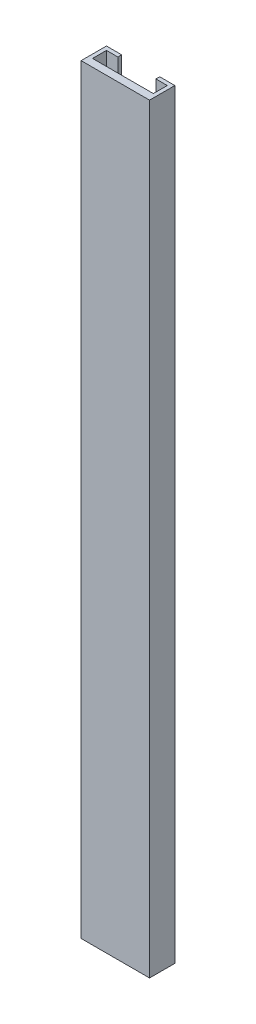
ISO-10303-21;
HEADER;
FILE_DESCRIPTION(('STEP AP214'),'2;1');
FILE_NAME('part.step','',(''),(''),'','','');
FILE_SCHEMA(('AUTOMOTIVE_DESIGN { 1 0 10303 214 1 1 1 1 }'));
ENDSEC;
DATA;
#1=APPLICATION_CONTEXT('core data for automotive mechanical design processes');
#2=APPLICATION_PROTOCOL_DEFINITION('international standard','automotive_design',2000,#1);
#3=PRODUCT_CONTEXT('',#1,'mechanical');
#4=PRODUCT('Part','Part','',(#3));
#5=PRODUCT_RELATED_PRODUCT_CATEGORY('part','',(#4));
#6=PRODUCT_DEFINITION_FORMATION('','',#4);
#7=PRODUCT_DEFINITION_CONTEXT('part definition',#1,'design');
#8=PRODUCT_DEFINITION('design','',#6,#7);
#9=PRODUCT_DEFINITION_SHAPE('','',#8);
#10=(LENGTH_UNIT() NAMED_UNIT(*) SI_UNIT(.MILLI.,.METRE.));
#11=(NAMED_UNIT(*) PLANE_ANGLE_UNIT() SI_UNIT($,.RADIAN.));
#12=(NAMED_UNIT(*) SI_UNIT($,.STERADIAN.) SOLID_ANGLE_UNIT());
#13=UNCERTAINTY_MEASURE_WITH_UNIT(LENGTH_MEASURE(1.E-05),#10,'distance_accuracy_value','');
#14=(GEOMETRIC_REPRESENTATION_CONTEXT(3) GLOBAL_UNCERTAINTY_ASSIGNED_CONTEXT((#13)) GLOBAL_UNIT_ASSIGNED_CONTEXT((#10,
#11,#12)) REPRESENTATION_CONTEXT('',''));
#15=CARTESIAN_POINT('',(0.,0.,0.));
#16=DIRECTION('',(0.,0.,1.));
#17=DIRECTION('',(1.,0.,0.));
#18=AXIS2_PLACEMENT_3D('',#15,#16,#17);
#19=CARTESIAN_POINT('',(13.5,300.,0.));
#20=DIRECTION('',(-1.,0.,0.));
#21=DIRECTION('',(0.,0.,1.));
#22=AXIS2_PLACEMENT_3D('',#19,#20,#21);
#23=PLANE('',#22);
#24=DIRECTION('',(0.,0.,-1.));
#25=VECTOR('',#24,1.);
#26=CARTESIAN_POINT('',(13.5,0.,0.));
#27=LINE('',#26,#25);
#28=CARTESIAN_POINT('',(13.5,0.,0.));
#29=VERTEX_POINT('',#28);
#30=CARTESIAN_POINT('',(13.5,0.,-10.));
#31=VERTEX_POINT('',#30);
#32=EDGE_CURVE('E164',#29,#31,#27,.T.);
#33=ORIENTED_EDGE('',*,*,#32,.T.);
#34=DIRECTION('',(0.,-1.,0.));
#35=VECTOR('',#34,1.);
#36=CARTESIAN_POINT('',(13.5,300.,-10.));
#37=LINE('',#36,#35);
#38=CARTESIAN_POINT('',(13.5,300.,-10.));
#39=VERTEX_POINT('',#38);
#40=EDGE_CURVE('E11',#39,#31,#37,.T.);
#41=ORIENTED_EDGE('',*,*,#40,.F.);
#42=DIRECTION('',(0.,0.,-1.));
#43=VECTOR('',#42,1.);
#44=CARTESIAN_POINT('',(13.5,300.,0.));
#45=LINE('',#44,#43);
#46=CARTESIAN_POINT('',(13.5,300.,0.));
#47=VERTEX_POINT('',#46);
#48=EDGE_CURVE('E198',#47,#39,#45,.T.);
#49=ORIENTED_EDGE('',*,*,#48,.F.);
#50=DIRECTION('',(0.,-1.,0.));
#51=VECTOR('',#50,1.);
#52=CARTESIAN_POINT('',(13.5,300.,0.));
#53=LINE('',#52,#51);
#54=EDGE_CURVE('E160',#47,#29,#53,.T.);
#55=ORIENTED_EDGE('',*,*,#54,.T.);
#56=EDGE_LOOP('',(#33,#41,#49,#55));
#57=FACE_BOUND('',#56,.T.);
#58=ADVANCED_FACE('F39',(#57),#23,.F.);
#59=CARTESIAN_POINT('',(13.5,300.,-10.));
#60=DIRECTION('',(0.,0.,1.));
#61=DIRECTION('',(1.,0.,0.));
#62=AXIS2_PLACEMENT_3D('',#59,#60,#61);
#63=PLANE('',#62);
#64=DIRECTION('',(-1.,0.,0.));
#65=VECTOR('',#64,1.);
#66=CARTESIAN_POINT('',(13.5,0.,-10.));
#67=LINE('',#66,#65);
#68=CARTESIAN_POINT('',(7.5,0.,-10.));
#69=VERTEX_POINT('',#68);
#70=EDGE_CURVE('E168',#31,#69,#67,.T.);
#71=ORIENTED_EDGE('',*,*,#70,.T.);
#72=DIRECTION('',(0.,-1.,0.));
#73=VECTOR('',#72,1.);
#74=CARTESIAN_POINT('',(7.5,300.,-10.));
#75=LINE('',#74,#73);
#76=CARTESIAN_POINT('',(7.5,300.,-10.));
#77=VERTEX_POINT('',#76);
#78=EDGE_CURVE('E48',#77,#69,#75,.T.);
#79=ORIENTED_EDGE('',*,*,#78,.F.);
#80=DIRECTION('',(-1.,0.,0.));
#81=VECTOR('',#80,1.);
#82=CARTESIAN_POINT('',(13.5,300.,-10.));
#83=LINE('',#82,#81);
#84=EDGE_CURVE('E111',#39,#77,#83,.T.);
#85=ORIENTED_EDGE('',*,*,#84,.F.);
#86=ORIENTED_EDGE('',*,*,#40,.T.);
#87=EDGE_LOOP('',(#71,#79,#85,#86));
#88=FACE_BOUND('',#87,.T.);
#89=ADVANCED_FACE('F292',(#88),#63,.F.);
#90=CARTESIAN_POINT('',(7.5,300.,-10.));
#91=DIRECTION('',(1.,0.,0.));
#92=DIRECTION('',(0.,0.,-1.));
#93=AXIS2_PLACEMENT_3D('',#90,#91,#92);
#94=PLANE('',#93);
#95=DIRECTION('',(0.,0.,1.));
#96=VECTOR('',#95,1.);
#97=CARTESIAN_POINT('',(7.5,0.,-10.));
#98=LINE('',#97,#96);
#99=CARTESIAN_POINT('',(7.5,0.,-8.5));
#100=VERTEX_POINT('',#99);
#101=EDGE_CURVE('E171',#69,#100,#98,.T.);
#102=ORIENTED_EDGE('',*,*,#101,.T.);
#103=DIRECTION('',(0.,-1.,0.));
#104=VECTOR('',#103,1.);
#105=CARTESIAN_POINT('',(7.5,300.,-8.5));
#106=LINE('',#105,#104);
#107=CARTESIAN_POINT('',(7.5,300.,-8.5));
#108=VERTEX_POINT('',#107);
#109=EDGE_CURVE('E225',#108,#100,#106,.T.);
#110=ORIENTED_EDGE('',*,*,#109,.F.);
#111=DIRECTION('',(0.,0.,1.));
#112=VECTOR('',#111,1.);
#113=CARTESIAN_POINT('',(7.5,300.,-10.));
#114=LINE('',#113,#112);
#115=EDGE_CURVE('E235',#77,#108,#114,.T.);
#116=ORIENTED_EDGE('',*,*,#115,.F.);
#117=ORIENTED_EDGE('',*,*,#78,.T.);
#118=EDGE_LOOP('',(#102,#110,#116,#117));
#119=FACE_BOUND('',#118,.T.);
#120=ADVANCED_FACE('F233',(#119),#94,.F.);
#121=CARTESIAN_POINT('',(7.5,300.,-8.5));
#122=DIRECTION('',(0.,0.,-1.));
#123=DIRECTION('',(-1.,0.,0.));
#124=AXIS2_PLACEMENT_3D('',#121,#122,#123);
#125=PLANE('',#124);
#126=DIRECTION('',(1.,0.,0.));
#127=VECTOR('',#126,1.);
#128=CARTESIAN_POINT('',(7.5,0.,-8.5));
#129=LINE('',#128,#127);
#130=CARTESIAN_POINT('',(12.,0.,-8.5));
#131=VERTEX_POINT('',#130);
#132=EDGE_CURVE('E174',#100,#131,#129,.T.);
#133=ORIENTED_EDGE('',*,*,#132,.T.);
#134=DIRECTION('',(0.,-1.,0.));
#135=VECTOR('',#134,1.);
#136=CARTESIAN_POINT('',(12.,300.,-8.5));
#137=LINE('',#136,#135);
#138=CARTESIAN_POINT('',(12.,300.,-8.5));
#139=VERTEX_POINT('',#138);
#140=EDGE_CURVE('E221',#139,#131,#137,.T.);
#141=ORIENTED_EDGE('',*,*,#140,.F.);
#142=DIRECTION('',(1.,0.,0.));
#143=VECTOR('',#142,1.);
#144=CARTESIAN_POINT('',(7.5,300.,-8.5));
#145=LINE('',#144,#143);
#146=EDGE_CURVE('E254',#108,#139,#145,.T.);
#147=ORIENTED_EDGE('',*,*,#146,.F.);
#148=ORIENTED_EDGE('',*,*,#109,.T.);
#149=EDGE_LOOP('',(#133,#141,#147,#148));
#150=FACE_BOUND('',#149,.T.);
#151=ADVANCED_FACE('F244',(#150),#125,.F.);
#152=CARTESIAN_POINT('',(12.,300.,-8.5));
#153=DIRECTION('',(1.,0.,0.));
#154=DIRECTION('',(0.,0.,-1.));
#155=AXIS2_PLACEMENT_3D('',#152,#153,#154);
#156=PLANE('',#155);
#157=DIRECTION('',(0.,0.,1.));
#158=VECTOR('',#157,1.);
#159=CARTESIAN_POINT('',(12.,0.,-8.5));
#160=LINE('',#159,#158);
#161=CARTESIAN_POINT('',(12.,0.,-3.));
#162=VERTEX_POINT('',#161);
#163=EDGE_CURVE('E177',#131,#162,#160,.T.);
#164=ORIENTED_EDGE('',*,*,#163,.T.);
#165=DIRECTION('',(0.,-1.,0.));
#166=VECTOR('',#165,1.);
#167=CARTESIAN_POINT('',(12.,300.,-3.));
#168=LINE('',#167,#166);
#169=CARTESIAN_POINT('',(12.,300.,-3.));
#170=VERTEX_POINT('',#169);
#171=EDGE_CURVE('E217',#170,#162,#168,.T.);
#172=ORIENTED_EDGE('',*,*,#171,.F.);
#173=DIRECTION('',(0.,0.,1.));
#174=VECTOR('',#173,1.);
#175=CARTESIAN_POINT('',(12.,300.,-8.5));
#176=LINE('',#175,#174);
#177=EDGE_CURVE('E250',#139,#170,#176,.T.);
#178=ORIENTED_EDGE('',*,*,#177,.F.);
#179=ORIENTED_EDGE('',*,*,#140,.T.);
#180=EDGE_LOOP('',(#164,#172,#178,#179));
#181=FACE_BOUND('',#180,.T.);
#182=ADVANCED_FACE('F248',(#181),#156,.F.);
#183=CARTESIAN_POINT('',(12.,300.,-3.));
#184=DIRECTION('',(0.,0.,1.));
#185=DIRECTION('',(1.,0.,0.));
#186=AXIS2_PLACEMENT_3D('',#183,#184,#185);
#187=PLANE('',#186);
#188=DIRECTION('',(-1.,0.,0.));
#189=VECTOR('',#188,1.);
#190=CARTESIAN_POINT('',(12.,0.,-3.));
#191=LINE('',#190,#189);
#192=CARTESIAN_POINT('',(-12.,0.,-3.));
#193=VERTEX_POINT('',#192);
#194=EDGE_CURVE('E180',#162,#193,#191,.T.);
#195=ORIENTED_EDGE('',*,*,#194,.T.);
#196=DIRECTION('',(0.,-1.,0.));
#197=VECTOR('',#196,1.);
#198=CARTESIAN_POINT('',(-12.,300.,-3.));
#199=LINE('',#198,#197);
#200=CARTESIAN_POINT('',(-12.,300.,-3.));
#201=VERTEX_POINT('',#200);
#202=EDGE_CURVE('E213',#201,#193,#199,.T.);
#203=ORIENTED_EDGE('',*,*,#202,.F.);
#204=DIRECTION('',(-1.,0.,0.));
#205=VECTOR('',#204,1.);
#206=CARTESIAN_POINT('',(12.,300.,-3.));
#207=LINE('',#206,#205);
#208=EDGE_CURVE('E253',#170,#201,#207,.T.);
#209=ORIENTED_EDGE('',*,*,#208,.F.);
#210=ORIENTED_EDGE('',*,*,#171,.T.);
#211=EDGE_LOOP('',(#195,#203,#209,#210));
#212=FACE_BOUND('',#211,.T.);
#213=ADVANCED_FACE('F305',(#212),#187,.F.);
#214=CARTESIAN_POINT('',(-12.,300.,-8.5));
#215=DIRECTION('',(-1.,0.,0.));
#216=DIRECTION('',(0.,0.,1.));
#217=AXIS2_PLACEMENT_3D('',#214,#215,#216);
#218=PLANE('',#217);
#219=DIRECTION('',(0.,0.,-1.));
#220=VECTOR('',#219,1.);
#221=CARTESIAN_POINT('',(-12.,0.,-8.5));
#222=LINE('',#221,#220);
#223=CARTESIAN_POINT('',(-12.,0.,-8.5));
#224=VERTEX_POINT('',#223);
#225=EDGE_CURVE('E183',#193,#224,#222,.T.);
#226=ORIENTED_EDGE('',*,*,#225,.T.);
#227=DIRECTION('',(0.,-1.,0.));
#228=VECTOR('',#227,1.);
#229=CARTESIAN_POINT('',(-12.,300.,-8.5));
#230=LINE('',#229,#228);
#231=CARTESIAN_POINT('',(-12.,300.,-8.5));
#232=VERTEX_POINT('',#231);
#233=EDGE_CURVE('E209',#232,#224,#230,.T.);
#234=ORIENTED_EDGE('',*,*,#233,.F.);
#235=DIRECTION('',(0.,0.,-1.));
#236=VECTOR('',#235,1.);
#237=CARTESIAN_POINT('',(-12.,300.,-8.5));
#238=LINE('',#237,#236);
#239=EDGE_CURVE('E258',#201,#232,#238,.T.);
#240=ORIENTED_EDGE('',*,*,#239,.F.);
#241=ORIENTED_EDGE('',*,*,#202,.T.);
#242=EDGE_LOOP('',(#226,#234,#240,#241));
#243=FACE_BOUND('',#242,.T.);
#244=ADVANCED_FACE('F308',(#243),#218,.F.);
#245=CARTESIAN_POINT('',(-7.5,300.,-8.5));
#246=DIRECTION('',(0.,0.,-1.));
#247=DIRECTION('',(-1.,0.,0.));
#248=AXIS2_PLACEMENT_3D('',#245,#246,#247);
#249=PLANE('',#248);
#250=DIRECTION('',(1.,0.,0.));
#251=VECTOR('',#250,1.);
#252=CARTESIAN_POINT('',(-7.5,0.,-8.5));
#253=LINE('',#252,#251);
#254=CARTESIAN_POINT('',(-7.5,0.,-8.5));
#255=VERTEX_POINT('',#254);
#256=EDGE_CURVE('E186',#224,#255,#253,.T.);
#257=ORIENTED_EDGE('',*,*,#256,.T.);
#258=DIRECTION('',(0.,-1.,0.));
#259=VECTOR('',#258,1.);
#260=CARTESIAN_POINT('',(-7.5,300.,-8.5));
#261=LINE('',#260,#259);
#262=CARTESIAN_POINT('',(-7.5,300.,-8.5));
#263=VERTEX_POINT('',#262);
#264=EDGE_CURVE('E205',#263,#255,#261,.T.);
#265=ORIENTED_EDGE('',*,*,#264,.F.);
#266=DIRECTION('',(1.,0.,0.));
#267=VECTOR('',#266,1.);
#268=CARTESIAN_POINT('',(-7.5,300.,-8.5));
#269=LINE('',#268,#267);
#270=EDGE_CURVE('E265',#232,#263,#269,.T.);
#271=ORIENTED_EDGE('',*,*,#270,.F.);
#272=ORIENTED_EDGE('',*,*,#233,.T.);
#273=EDGE_LOOP('',(#257,#265,#271,#272));
#274=FACE_BOUND('',#273,.T.);
#275=ADVANCED_FACE('F273',(#274),#249,.F.);
#276=CARTESIAN_POINT('',(-7.5,300.,-10.));
#277=DIRECTION('',(-1.,0.,0.));
#278=DIRECTION('',(0.,0.,1.));
#279=AXIS2_PLACEMENT_3D('',#276,#277,#278);
#280=PLANE('',#279);
#281=DIRECTION('',(0.,0.,-1.));
#282=VECTOR('',#281,1.);
#283=CARTESIAN_POINT('',(-7.5,0.,-10.));
#284=LINE('',#283,#282);
#285=CARTESIAN_POINT('',(-7.5,0.,-10.));
#286=VERTEX_POINT('',#285);
#287=EDGE_CURVE('E189',#255,#286,#284,.T.);
#288=ORIENTED_EDGE('',*,*,#287,.T.);
#289=DIRECTION('',(0.,-1.,0.));
#290=VECTOR('',#289,1.);
#291=CARTESIAN_POINT('',(-7.5,300.,-10.));
#292=LINE('',#291,#290);
#293=CARTESIAN_POINT('',(-7.5,300.,-10.));
#294=VERTEX_POINT('',#293);
#295=EDGE_CURVE('E153',#294,#286,#292,.T.);
#296=ORIENTED_EDGE('',*,*,#295,.F.);
#297=DIRECTION('',(0.,0.,-1.));
#298=VECTOR('',#297,1.);
#299=CARTESIAN_POINT('',(-7.5,300.,-10.));
#300=LINE('',#299,#298);
#301=EDGE_CURVE('E142',#263,#294,#300,.T.);
#302=ORIENTED_EDGE('',*,*,#301,.F.);
#303=ORIENTED_EDGE('',*,*,#264,.T.);
#304=EDGE_LOOP('',(#288,#296,#302,#303));
#305=FACE_BOUND('',#304,.T.);
#306=ADVANCED_FACE('F277',(#305),#280,.F.);
#307=CARTESIAN_POINT('',(-13.5,300.,-10.));
#308=DIRECTION('',(0.,0.,1.));
#309=DIRECTION('',(1.,0.,0.));
#310=AXIS2_PLACEMENT_3D('',#307,#308,#309);
#311=PLANE('',#310);
#312=DIRECTION('',(-1.,0.,0.));
#313=VECTOR('',#312,1.);
#314=CARTESIAN_POINT('',(-13.5,0.,-10.));
#315=LINE('',#314,#313);
#316=CARTESIAN_POINT('',(-13.5,0.,-10.));
#317=VERTEX_POINT('',#316);
#318=EDGE_CURVE('E151',#286,#317,#315,.T.);
#319=ORIENTED_EDGE('',*,*,#318,.T.);
#320=DIRECTION('',(0.,-1.,0.));
#321=VECTOR('',#320,1.);
#322=CARTESIAN_POINT('',(-13.5,300.,-10.));
#323=LINE('',#322,#321);
#324=CARTESIAN_POINT('',(-13.5,300.,-10.));
#325=VERTEX_POINT('',#324);
#326=EDGE_CURVE('E148',#325,#317,#323,.T.);
#327=ORIENTED_EDGE('',*,*,#326,.F.);
#328=DIRECTION('',(-1.,0.,0.));
#329=VECTOR('',#328,1.);
#330=CARTESIAN_POINT('',(-13.5,300.,-10.));
#331=LINE('',#330,#329);
#332=EDGE_CURVE('E136',#294,#325,#331,.T.);
#333=ORIENTED_EDGE('',*,*,#332,.F.);
#334=ORIENTED_EDGE('',*,*,#295,.T.);
#335=EDGE_LOOP('',(#319,#327,#333,#334));
#336=FACE_BOUND('',#335,.T.);
#337=ADVANCED_FACE('F149',(#336),#311,.F.);
#338=CARTESIAN_POINT('',(-13.5,300.,0.));
#339=DIRECTION('',(1.,0.,0.));
#340=DIRECTION('',(0.,0.,-1.));
#341=AXIS2_PLACEMENT_3D('',#338,#339,#340);
#342=PLANE('',#341);
#343=DIRECTION('',(0.,0.,1.));
#344=VECTOR('',#343,1.);
#345=CARTESIAN_POINT('',(-13.5,0.,0.));
#346=LINE('',#345,#344);
#347=CARTESIAN_POINT('',(-13.5,0.,0.));
#348=VERTEX_POINT('',#347);
#349=EDGE_CURVE('E97',#317,#348,#346,.T.);
#350=ORIENTED_EDGE('',*,*,#349,.T.);
#351=DIRECTION('',(0.,-1.,0.));
#352=VECTOR('',#351,1.);
#353=CARTESIAN_POINT('',(-13.5,300.,0.));
#354=LINE('',#353,#352);
#355=CARTESIAN_POINT('',(-13.5,300.,0.));
#356=VERTEX_POINT('',#355);
#357=EDGE_CURVE('E154',#356,#348,#354,.T.);
#358=ORIENTED_EDGE('',*,*,#357,.F.);
#359=DIRECTION('',(0.,0.,1.));
#360=VECTOR('',#359,1.);
#361=CARTESIAN_POINT('',(-13.5,300.,0.));
#362=LINE('',#361,#360);
#363=EDGE_CURVE('E140',#325,#356,#362,.T.);
#364=ORIENTED_EDGE('',*,*,#363,.F.);
#365=ORIENTED_EDGE('',*,*,#326,.T.);
#366=EDGE_LOOP('',(#350,#358,#364,#365));
#367=FACE_BOUND('',#366,.T.);
#368=ADVANCED_FACE('F156',(#367),#342,.F.);
#369=CARTESIAN_POINT('',(-13.5,300.,0.));
#370=DIRECTION('',(0.,0.,-1.));
#371=DIRECTION('',(-1.,0.,0.));
#372=AXIS2_PLACEMENT_3D('',#369,#370,#371);
#373=PLANE('',#372);
#374=DIRECTION('',(1.,0.,0.));
#375=VECTOR('',#374,1.);
#376=CARTESIAN_POINT('',(-13.5,0.,0.));
#377=LINE('',#376,#375);
#378=EDGE_CURVE('E103',#348,#29,#377,.T.);
#379=ORIENTED_EDGE('',*,*,#378,.T.);
#380=ORIENTED_EDGE('',*,*,#54,.F.);
#381=DIRECTION('',(1.,0.,0.));
#382=VECTOR('',#381,1.);
#383=CARTESIAN_POINT('',(-13.5,300.,0.));
#384=LINE('',#383,#382);
#385=EDGE_CURVE('E56',#356,#47,#384,.T.);
#386=ORIENTED_EDGE('',*,*,#385,.F.);
#387=ORIENTED_EDGE('',*,*,#357,.T.);
#388=EDGE_LOOP('',(#379,#380,#386,#387));
#389=FACE_BOUND('',#388,.T.);
#390=ADVANCED_FACE('F281',(#389),#373,.F.);
#391=CARTESIAN_POINT('',(0.,300.,0.));
#392=DIRECTION('',(0.,1.,0.));
#393=DIRECTION('',(0.,0.,1.));
#394=AXIS2_PLACEMENT_3D('',#391,#392,#393);
#395=PLANE('',#394);
#396=ORIENTED_EDGE('',*,*,#48,.T.);
#397=ORIENTED_EDGE('',*,*,#84,.T.);
#398=ORIENTED_EDGE('',*,*,#115,.T.);
#399=ORIENTED_EDGE('',*,*,#146,.T.);
#400=ORIENTED_EDGE('',*,*,#177,.T.);
#401=ORIENTED_EDGE('',*,*,#208,.T.);
#402=ORIENTED_EDGE('',*,*,#239,.T.);
#403=ORIENTED_EDGE('',*,*,#270,.T.);
#404=ORIENTED_EDGE('',*,*,#301,.T.);
#405=ORIENTED_EDGE('',*,*,#332,.T.);
#406=ORIENTED_EDGE('',*,*,#363,.T.);
#407=ORIENTED_EDGE('',*,*,#385,.T.);
#408=EDGE_LOOP('',(#396,#397,#398,#399,#400,#401,#402,#403,#404,#405,#406,#407));
#409=FACE_BOUND('',#408,.T.);
#410=ADVANCED_FACE('F138',(#409),#395,.T.);
#411=CARTESIAN_POINT('',(0.,0.,0.));
#412=DIRECTION('',(0.,1.,0.));
#413=DIRECTION('',(0.,0.,1.));
#414=AXIS2_PLACEMENT_3D('',#411,#412,#413);
#415=PLANE('',#414);
#416=ORIENTED_EDGE('',*,*,#32,.F.);
#417=ORIENTED_EDGE('',*,*,#378,.F.);
#418=ORIENTED_EDGE('',*,*,#349,.F.);
#419=ORIENTED_EDGE('',*,*,#318,.F.);
#420=ORIENTED_EDGE('',*,*,#287,.F.);
#421=ORIENTED_EDGE('',*,*,#256,.F.);
#422=ORIENTED_EDGE('',*,*,#225,.F.);
#423=ORIENTED_EDGE('',*,*,#194,.F.);
#424=ORIENTED_EDGE('',*,*,#163,.F.);
#425=ORIENTED_EDGE('',*,*,#132,.F.);
#426=ORIENTED_EDGE('',*,*,#101,.F.);
#427=ORIENTED_EDGE('',*,*,#70,.F.);
#428=EDGE_LOOP('',(#416,#417,#418,#419,#420,#421,#422,#423,#424,#425,#426,#427));
#429=FACE_BOUND('',#428,.T.);
#430=ADVANCED_FACE('F239',(#429),#415,.F.);
#431=CLOSED_SHELL('',(#58,#89,#120,#151,#182,#213,#244,#275,#306,#337,#368,#390,#410,#430));
#432=MANIFOLD_SOLID_BREP('B2',#431);
#433=ADVANCED_BREP_SHAPE_REPRESENTATION('',(#18,#432),#14);
#434=SHAPE_DEFINITION_REPRESENTATION(#9,#433);
ENDSEC;
END-ISO-10303-21;
